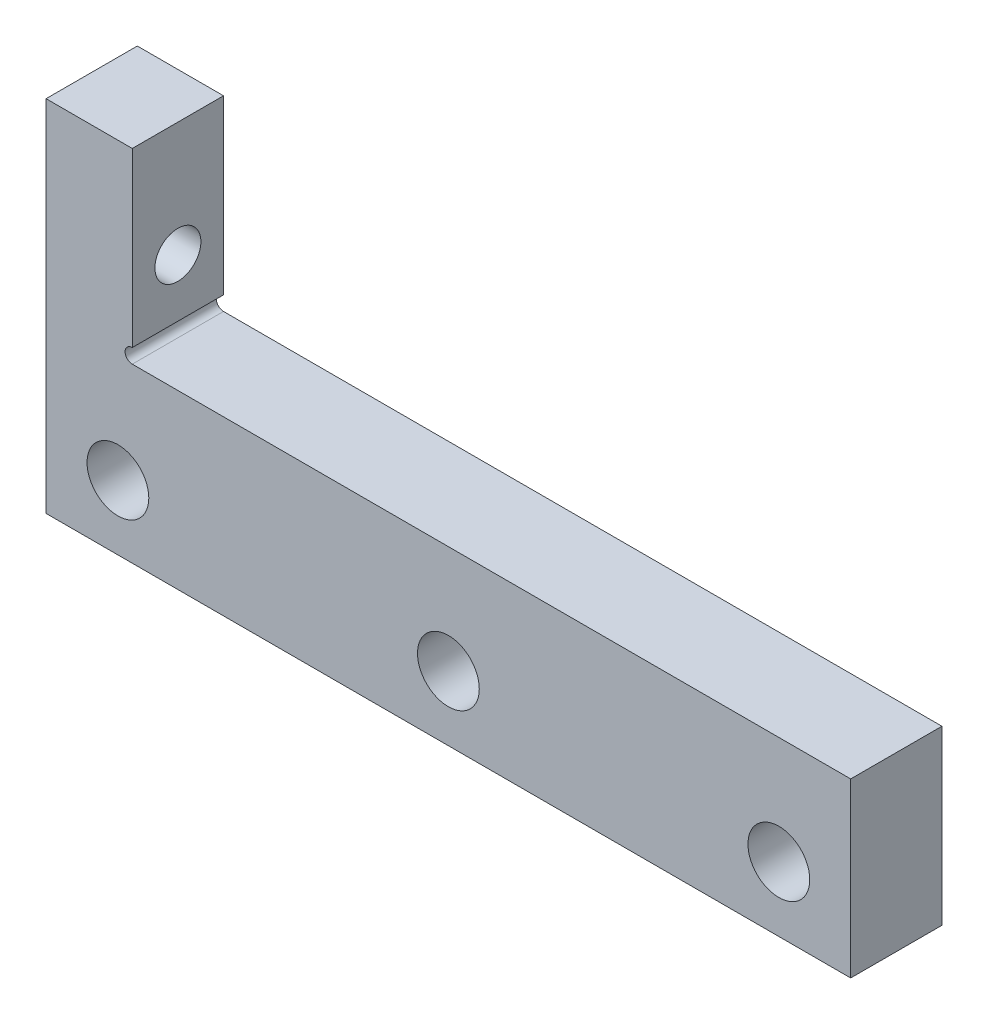
ISO-10303-21;
HEADER;
FILE_DESCRIPTION(('STEP AP214'),'2;1');
FILE_NAME('part.step','',(''),(''),'','','');
FILE_SCHEMA(('AUTOMOTIVE_DESIGN { 1 0 10303 214 1 1 1 1 }'));
ENDSEC;
DATA;
#1=APPLICATION_CONTEXT('core data for automotive mechanical design processes');
#2=APPLICATION_PROTOCOL_DEFINITION('international standard','automotive_design',2000,#1);
#3=PRODUCT_CONTEXT('',#1,'mechanical');
#4=PRODUCT('Part','Part','',(#3));
#5=PRODUCT_RELATED_PRODUCT_CATEGORY('part','',(#4));
#6=PRODUCT_DEFINITION_FORMATION('','',#4);
#7=PRODUCT_DEFINITION_CONTEXT('part definition',#1,'design');
#8=PRODUCT_DEFINITION('design','',#6,#7);
#9=PRODUCT_DEFINITION_SHAPE('','',#8);
#10=(LENGTH_UNIT() NAMED_UNIT(*) SI_UNIT(.MILLI.,.METRE.));
#11=(NAMED_UNIT(*) PLANE_ANGLE_UNIT() SI_UNIT($,.RADIAN.));
#12=(NAMED_UNIT(*) SI_UNIT($,.STERADIAN.) SOLID_ANGLE_UNIT());
#13=UNCERTAINTY_MEASURE_WITH_UNIT(LENGTH_MEASURE(1.E-05),#10,'distance_accuracy_value','');
#14=(GEOMETRIC_REPRESENTATION_CONTEXT(3) GLOBAL_UNCERTAINTY_ASSIGNED_CONTEXT((#13)) GLOBAL_UNIT_ASSIGNED_CONTEXT((#10,
#11,#12)) REPRESENTATION_CONTEXT('',''));
#15=CARTESIAN_POINT('',(0.,0.,0.));
#16=DIRECTION('',(0.,0.,1.));
#17=DIRECTION('',(1.,0.,0.));
#18=AXIS2_PLACEMENT_3D('',#15,#16,#17);
#19=CARTESIAN_POINT('',(-14.499,169.786291501016,0.));
#20=DIRECTION('',(-1.,0.,0.));
#21=DIRECTION('',(0.,-1.,0.));
#22=AXIS2_PLACEMENT_3D('',#19,#20,#21);
#23=CYLINDRICAL_SURFACE('',#22,1.6);
#24=CARTESIAN_POINT('',(-64.5,169.786291501016,0.));
#25=DIRECTION('',(-1.,0.,0.));
#26=DIRECTION('',(0.,0.,1.));
#27=AXIS2_PLACEMENT_3D('',#24,#25,#26);
#28=CIRCLE('',#27,1.6);
#29=CARTESIAN_POINT('',(-64.5,169.786291501016,1.6));
#30=VERTEX_POINT('',#29);
#31=EDGE_CURVE('E111',#30,#30,#28,.F.);
#32=ORIENTED_EDGE('',*,*,#31,.T.);
#33=EDGE_LOOP('',(#32));
#34=FACE_BOUND('',#33,.T.);
#35=CARTESIAN_POINT('',(-68.,169.786291501016,0.));
#36=DIRECTION('',(-1.,0.,0.));
#37=DIRECTION('',(0.,-1.,0.));
#38=AXIS2_PLACEMENT_3D('',#35,#36,#37);
#39=CIRCLE('',#38,1.6);
#40=CARTESIAN_POINT('',(-68.,168.186291501016,0.));
#41=VERTEX_POINT('',#40);
#42=EDGE_CURVE('E35',#41,#41,#39,.F.);
#43=ORIENTED_EDGE('',*,*,#42,.F.);
#44=EDGE_LOOP('',(#43));
#45=FACE_BOUND('',#44,.T.);
#46=ADVANCED_FACE('F31',(#34,#45),#23,.F.);
#47=CARTESIAN_POINT('',(-65.5,157.286291501019,64.5019924258466));
#48=DIRECTION('',(0.,0.,-1.));
#49=DIRECTION('',(-1.,0.,0.));
#50=AXIS2_PLACEMENT_3D('',#47,#48,#49);
#51=CYLINDRICAL_SURFACE('',#50,2.15);
#52=CARTESIAN_POINT('',(-65.5,157.286291501019,3.175));
#53=DIRECTION('',(0.,0.,1.));
#54=DIRECTION('',(1.,0.,0.));
#55=AXIS2_PLACEMENT_3D('',#52,#53,#54);
#56=CIRCLE('',#55,2.15);
#57=CARTESIAN_POINT('',(-63.35,157.286291501019,3.175));
#58=VERTEX_POINT('',#57);
#59=EDGE_CURVE('E138',#58,#58,#56,.T.);
#60=ORIENTED_EDGE('',*,*,#59,.T.);
#61=EDGE_LOOP('',(#60));
#62=FACE_BOUND('',#61,.T.);
#63=CARTESIAN_POINT('',(-65.5,157.286291501019,-3.175));
#64=DIRECTION('',(0.,0.,1.));
#65=DIRECTION('',(1.,0.,0.));
#66=AXIS2_PLACEMENT_3D('',#63,#64,#65);
#67=CIRCLE('',#66,2.15);
#68=CARTESIAN_POINT('',(-63.35,157.286291501019,-3.175));
#69=VERTEX_POINT('',#68);
#70=EDGE_CURVE('E123',#69,#69,#67,.F.);
#71=ORIENTED_EDGE('',*,*,#70,.T.);
#72=EDGE_LOOP('',(#71));
#73=FACE_BOUND('',#72,.T.);
#74=ADVANCED_FACE('F172',(#62,#73),#51,.F.);
#75=CARTESIAN_POINT('',(-70.5,177.786291501017,64.5019924258466));
#76=DIRECTION('',(0.,-1.,0.));
#77=DIRECTION('',(0.,0.,-1.));
#78=AXIS2_PLACEMENT_3D('',#75,#76,#77);
#79=PLANE('',#78);
#80=DIRECTION('',(-1.,0.,0.));
#81=VECTOR('',#80,1.);
#82=CARTESIAN_POINT('',(-70.5,177.786291501017,3.175));
#83=LINE('',#82,#81);
#84=CARTESIAN_POINT('',(-64.5,177.786291501017,3.175));
#85=VERTEX_POINT('',#84);
#86=CARTESIAN_POINT('',(-70.5,177.786291501017,3.175));
#87=VERTEX_POINT('',#86);
#88=EDGE_CURVE('E142',#85,#87,#83,.T.);
#89=ORIENTED_EDGE('',*,*,#88,.F.);
#90=DIRECTION('',(0.,0.,-1.));
#91=VECTOR('',#90,1.);
#92=CARTESIAN_POINT('',(-64.5,177.786291501017,64.5019924258466));
#93=LINE('',#92,#91);
#94=CARTESIAN_POINT('',(-64.5,177.786291501017,-3.175));
#95=VERTEX_POINT('',#94);
#96=EDGE_CURVE('E48',#85,#95,#93,.T.);
#97=ORIENTED_EDGE('',*,*,#96,.T.);
#98=DIRECTION('',(1.,0.,0.));
#99=VECTOR('',#98,1.);
#100=CARTESIAN_POINT('',(-70.5,177.786291501017,-3.175));
#101=LINE('',#100,#99);
#102=CARTESIAN_POINT('',(-70.5,177.786291501017,-3.175));
#103=VERTEX_POINT('',#102);
#104=EDGE_CURVE('E120',#103,#95,#101,.T.);
#105=ORIENTED_EDGE('',*,*,#104,.F.);
#106=DIRECTION('',(0.,0.,-1.));
#107=VECTOR('',#106,1.);
#108=CARTESIAN_POINT('',(-70.5,177.786291501017,64.5019924258466));
#109=LINE('',#108,#107);
#110=EDGE_CURVE('E159',#87,#103,#109,.T.);
#111=ORIENTED_EDGE('',*,*,#110,.F.);
#112=EDGE_LOOP('',(#89,#97,#105,#111));
#113=FACE_BOUND('',#112,.T.);
#114=ADVANCED_FACE('F194',(#113),#79,.F.);
#115=CARTESIAN_POINT('',(-64.5,177.786291501017,64.5019924258466));
#116=DIRECTION('',(-1.,0.,0.));
#117=DIRECTION('',(0.,0.,1.));
#118=AXIS2_PLACEMENT_3D('',#115,#116,#117);
#119=PLANE('',#118);
#120=ORIENTED_EDGE('',*,*,#31,.F.);
#121=EDGE_LOOP('',(#120));
#122=FACE_BOUND('',#121,.T.);
#123=DIRECTION('',(0.,1.,0.));
#124=VECTOR('',#123,1.);
#125=CARTESIAN_POINT('',(-64.5,177.786291501017,3.175));
#126=LINE('',#125,#124);
#127=CARTESIAN_POINT('',(-64.5,165.78629150102,3.175));
#128=VERTEX_POINT('',#127);
#129=EDGE_CURVE('E145',#128,#85,#126,.T.);
#130=ORIENTED_EDGE('',*,*,#129,.F.);
#131=DIRECTION('',(0.,0.,-1.));
#132=VECTOR('',#131,1.);
#133=CARTESIAN_POINT('',(-64.5,165.78629150102,64.5019924258466));
#134=LINE('',#133,#132);
#135=CARTESIAN_POINT('',(-64.5,165.78629150102,-3.175));
#136=VERTEX_POINT('',#135);
#137=EDGE_CURVE('E162',#128,#136,#134,.T.);
#138=ORIENTED_EDGE('',*,*,#137,.T.);
#139=DIRECTION('',(0.,-1.,0.));
#140=VECTOR('',#139,1.);
#141=CARTESIAN_POINT('',(-64.5,177.786291501017,-3.175));
#142=LINE('',#141,#140);
#143=EDGE_CURVE('E128',#95,#136,#142,.T.);
#144=ORIENTED_EDGE('',*,*,#143,.F.);
#145=ORIENTED_EDGE('',*,*,#96,.F.);
#146=EDGE_LOOP('',(#130,#138,#144,#145));
#147=FACE_BOUND('',#146,.T.);
#148=ADVANCED_FACE('F245',(#122,#147),#119,.F.);
#149=CARTESIAN_POINT('',(-64.5000000000001,165.28629150102,64.5019924258466));
#150=DIRECTION('',(0.,0.,-1.));
#151=DIRECTION('',(-1.,0.,0.));
#152=AXIS2_PLACEMENT_3D('',#149,#150,#151);
#153=CYLINDRICAL_SURFACE('',#152,0.499999999999973);
#154=CARTESIAN_POINT('',(-64.5000000000001,165.28629150102,3.175));
#155=DIRECTION('',(0.,0.,1.));
#156=DIRECTION('',(1.,0.,0.));
#157=AXIS2_PLACEMENT_3D('',#154,#155,#156);
#158=CIRCLE('',#157,0.499999999999973);
#159=CARTESIAN_POINT('',(-64.5000000000001,164.78629150102,3.175));
#160=VERTEX_POINT('',#159);
#161=EDGE_CURVE('E148',#160,#128,#158,.F.);
#162=ORIENTED_EDGE('',*,*,#161,.F.);
#163=DIRECTION('',(0.,0.,-1.));
#164=VECTOR('',#163,1.);
#165=CARTESIAN_POINT('',(-64.5000000000001,164.78629150102,64.5019924258466));
#166=LINE('',#165,#164);
#167=CARTESIAN_POINT('',(-64.5000000000001,164.78629150102,-3.175));
#168=VERTEX_POINT('',#167);
#169=EDGE_CURVE('E164',#160,#168,#166,.T.);
#170=ORIENTED_EDGE('',*,*,#169,.T.);
#171=CARTESIAN_POINT('',(-64.5000000000001,165.28629150102,-3.175));
#172=DIRECTION('',(0.,0.,1.));
#173=DIRECTION('',(1.,0.,0.));
#174=AXIS2_PLACEMENT_3D('',#171,#172,#173);
#175=CIRCLE('',#174,0.499999999999973);
#176=EDGE_CURVE('E126',#136,#168,#175,.T.);
#177=ORIENTED_EDGE('',*,*,#176,.F.);
#178=ORIENTED_EDGE('',*,*,#137,.F.);
#179=EDGE_LOOP('',(#162,#170,#177,#178));
#180=FACE_BOUND('',#179,.T.);
#181=ADVANCED_FACE('F247',(#180),#153,.F.);
#182=CARTESIAN_POINT('',(-59.5,164.786291501016,64.5019924258466));
#183=DIRECTION('',(-7.16093850883224E-13,-1.,0.));
#184=DIRECTION('',(1.,-7.16093850883224E-13,0.));
#185=AXIS2_PLACEMENT_3D('',#182,#183,#184);
#186=PLANE('',#185);
#187=DIRECTION('',(-1.,7.16093850883224E-13,0.));
#188=VECTOR('',#187,1.);
#189=CARTESIAN_POINT('',(-59.5,164.786291501016,3.175));
#190=LINE('',#189,#188);
#191=CARTESIAN_POINT('',(-14.5,164.78629150102,3.175));
#192=VERTEX_POINT('',#191);
#193=EDGE_CURVE('E151',#192,#160,#190,.T.);
#194=ORIENTED_EDGE('',*,*,#193,.F.);
#195=DIRECTION('',(0.,0.,-1.));
#196=VECTOR('',#195,1.);
#197=CARTESIAN_POINT('',(-14.5,164.78629150102,64.5019924258466));
#198=LINE('',#197,#196);
#199=CARTESIAN_POINT('',(-14.5,164.78629150102,-3.175));
#200=VERTEX_POINT('',#199);
#201=EDGE_CURVE('E98',#192,#200,#198,.T.);
#202=ORIENTED_EDGE('',*,*,#201,.T.);
#203=DIRECTION('',(1.,-7.16093850883224E-13,0.));
#204=VECTOR('',#203,1.);
#205=CARTESIAN_POINT('',(-59.5,164.786291501016,-3.175));
#206=LINE('',#205,#204);
#207=EDGE_CURVE('E110',#168,#200,#206,.T.);
#208=ORIENTED_EDGE('',*,*,#207,.F.);
#209=ORIENTED_EDGE('',*,*,#169,.F.);
#210=EDGE_LOOP('',(#194,#202,#208,#209));
#211=FACE_BOUND('',#210,.T.);
#212=ADVANCED_FACE('F255',(#211),#186,.F.);
#213=CARTESIAN_POINT('',(-14.5,164.78629150102,64.5019924258466));
#214=DIRECTION('',(-1.,0.,0.));
#215=DIRECTION('',(0.,-1.,0.));
#216=AXIS2_PLACEMENT_3D('',#213,#214,#215);
#217=PLANE('',#216);
#218=DIRECTION('',(0.,1.,0.));
#219=VECTOR('',#218,1.);
#220=CARTESIAN_POINT('',(-14.5,164.78629150102,3.175));
#221=LINE('',#220,#219);
#222=CARTESIAN_POINT('',(-14.5,152.78629150102,3.175));
#223=VERTEX_POINT('',#222);
#224=EDGE_CURVE('E96',#223,#192,#221,.T.);
#225=ORIENTED_EDGE('',*,*,#224,.F.);
#226=DIRECTION('',(0.,0.,-1.));
#227=VECTOR('',#226,1.);
#228=CARTESIAN_POINT('',(-14.5,152.78629150102,64.5019924258466));
#229=LINE('',#228,#227);
#230=CARTESIAN_POINT('',(-14.5,152.78629150102,-3.175));
#231=VERTEX_POINT('',#230);
#232=EDGE_CURVE('E40',#223,#231,#229,.T.);
#233=ORIENTED_EDGE('',*,*,#232,.T.);
#234=DIRECTION('',(0.,-1.,0.));
#235=VECTOR('',#234,1.);
#236=CARTESIAN_POINT('',(-14.5,164.78629150102,-3.175));
#237=LINE('',#236,#235);
#238=EDGE_CURVE('E94',#200,#231,#237,.T.);
#239=ORIENTED_EDGE('',*,*,#238,.F.);
#240=ORIENTED_EDGE('',*,*,#201,.F.);
#241=EDGE_LOOP('',(#225,#233,#239,#240));
#242=FACE_BOUND('',#241,.T.);
#243=ADVANCED_FACE('F92',(#242),#217,.F.);
#244=CARTESIAN_POINT('',(-14.5,152.78629150102,64.5019924258466));
#245=DIRECTION('',(0.,1.,0.));
#246=DIRECTION('',(0.,0.,1.));
#247=AXIS2_PLACEMENT_3D('',#244,#245,#246);
#248=PLANE('',#247);
#249=DIRECTION('',(1.,0.,0.));
#250=VECTOR('',#249,1.);
#251=CARTESIAN_POINT('',(-14.5,152.78629150102,3.175));
#252=LINE('',#251,#250);
#253=CARTESIAN_POINT('',(-70.5000000000001,152.78629150102,3.175));
#254=VERTEX_POINT('',#253);
#255=EDGE_CURVE('E55',#254,#223,#252,.T.);
#256=ORIENTED_EDGE('',*,*,#255,.F.);
#257=DIRECTION('',(0.,0.,-1.));
#258=VECTOR('',#257,1.);
#259=CARTESIAN_POINT('',(-70.5000000000001,152.78629150102,64.5019924258466));
#260=LINE('',#259,#258);
#261=CARTESIAN_POINT('',(-70.5000000000001,152.78629150102,-3.175));
#262=VERTEX_POINT('',#261);
#263=EDGE_CURVE('E11',#254,#262,#260,.T.);
#264=ORIENTED_EDGE('',*,*,#263,.T.);
#265=DIRECTION('',(-1.,0.,0.));
#266=VECTOR('',#265,1.);
#267=CARTESIAN_POINT('',(-14.5,152.78629150102,-3.175));
#268=LINE('',#267,#266);
#269=EDGE_CURVE('E106',#231,#262,#268,.T.);
#270=ORIENTED_EDGE('',*,*,#269,.F.);
#271=ORIENTED_EDGE('',*,*,#232,.F.);
#272=EDGE_LOOP('',(#256,#264,#270,#271));
#273=FACE_BOUND('',#272,.T.);
#274=ADVANCED_FACE('F113',(#273),#248,.F.);
#275=CARTESIAN_POINT('',(-70.5000000000001,152.78629150102,64.5019924258466));
#276=DIRECTION('',(1.,0.,0.));
#277=DIRECTION('',(0.,1.,0.));
#278=AXIS2_PLACEMENT_3D('',#275,#276,#277);
#279=PLANE('',#278);
#280=CARTESIAN_POINT('',(-70.5000000000001,164.286291501016,0.));
#281=DIRECTION('',(-1.,0.,0.));
#282=DIRECTION('',(0.,-1.,0.));
#283=AXIS2_PLACEMENT_3D('',#280,#281,#282);
#284=CIRCLE('',#283,1.34999999999999);
#285=CARTESIAN_POINT('',(-70.5000000000001,162.936291501016,0.));
#286=VERTEX_POINT('',#285);
#287=EDGE_CURVE('E224',#286,#286,#284,.T.);
#288=ORIENTED_EDGE('',*,*,#287,.F.);
#289=EDGE_LOOP('',(#288));
#290=FACE_BOUND('',#289,.T.);
#291=CARTESIAN_POINT('',(-70.5,175.286291501016,0.));
#292=DIRECTION('',(-1.,0.,0.));
#293=DIRECTION('',(0.,-1.,0.));
#294=AXIS2_PLACEMENT_3D('',#291,#292,#293);
#295=CIRCLE('',#294,1.34999999999999);
#296=CARTESIAN_POINT('',(-70.5,173.936291501016,0.));
#297=VERTEX_POINT('',#296);
#298=EDGE_CURVE('E223',#297,#297,#295,.T.);
#299=ORIENTED_EDGE('',*,*,#298,.F.);
#300=EDGE_LOOP('',(#299));
#301=FACE_BOUND('',#300,.T.);
#302=CARTESIAN_POINT('',(-70.5,169.786291501016,0.));
#303=DIRECTION('',(-1.,0.,0.));
#304=DIRECTION('',(0.,-1.,0.));
#305=AXIS2_PLACEMENT_3D('',#302,#303,#304);
#306=CIRCLE('',#305,3.);
#307=CARTESIAN_POINT('',(-70.5,166.786291501016,0.));
#308=VERTEX_POINT('',#307);
#309=EDGE_CURVE('E233',#308,#308,#306,.T.);
#310=ORIENTED_EDGE('',*,*,#309,.F.);
#311=EDGE_LOOP('',(#310));
#312=FACE_BOUND('',#311,.T.);
#313=DIRECTION('',(0.,-1.,0.));
#314=VECTOR('',#313,1.);
#315=CARTESIAN_POINT('',(-70.5000000000001,152.78629150102,3.175));
#316=LINE('',#315,#314);
#317=EDGE_CURVE('E156',#87,#254,#316,.T.);
#318=ORIENTED_EDGE('',*,*,#317,.F.);
#319=ORIENTED_EDGE('',*,*,#110,.T.);
#320=DIRECTION('',(0.,1.,0.));
#321=VECTOR('',#320,1.);
#322=CARTESIAN_POINT('',(-70.5000000000001,152.78629150102,-3.175));
#323=LINE('',#322,#321);
#324=EDGE_CURVE('E115',#262,#103,#323,.T.);
#325=ORIENTED_EDGE('',*,*,#324,.F.);
#326=ORIENTED_EDGE('',*,*,#263,.F.);
#327=EDGE_LOOP('',(#318,#319,#325,#326));
#328=FACE_BOUND('',#327,.T.);
#329=ADVANCED_FACE('F33',(#290,#301,#312,#328),#279,.F.);
#330=CARTESIAN_POINT('',(-42.5,157.286291501019,64.5019924258466));
#331=DIRECTION('',(0.,0.,-1.));
#332=DIRECTION('',(-1.,0.,0.));
#333=AXIS2_PLACEMENT_3D('',#330,#331,#332);
#334=CYLINDRICAL_SURFACE('',#333,2.15000000000002);
#335=CARTESIAN_POINT('',(-42.5,157.286291501019,3.175));
#336=DIRECTION('',(0.,0.,1.));
#337=DIRECTION('',(1.,0.,0.));
#338=AXIS2_PLACEMENT_3D('',#335,#336,#337);
#339=CIRCLE('',#338,2.15000000000002);
#340=CARTESIAN_POINT('',(-40.35,157.286291501019,3.175));
#341=VERTEX_POINT('',#340);
#342=EDGE_CURVE('E135',#341,#341,#339,.T.);
#343=ORIENTED_EDGE('',*,*,#342,.T.);
#344=EDGE_LOOP('',(#343));
#345=FACE_BOUND('',#344,.T.);
#346=CARTESIAN_POINT('',(-42.5,157.286291501019,-3.175));
#347=DIRECTION('',(0.,0.,1.));
#348=DIRECTION('',(1.,0.,0.));
#349=AXIS2_PLACEMENT_3D('',#346,#347,#348);
#350=CIRCLE('',#349,2.15000000000002);
#351=CARTESIAN_POINT('',(-40.35,157.286291501019,-3.175));
#352=VERTEX_POINT('',#351);
#353=EDGE_CURVE('E114',#352,#352,#350,.F.);
#354=ORIENTED_EDGE('',*,*,#353,.T.);
#355=EDGE_LOOP('',(#354));
#356=FACE_BOUND('',#355,.T.);
#357=ADVANCED_FACE('F261',(#345,#356),#334,.F.);
#358=CARTESIAN_POINT('',(-19.5,157.286291501019,64.5019924258466));
#359=DIRECTION('',(0.,0.,-1.));
#360=DIRECTION('',(-1.,0.,0.));
#361=AXIS2_PLACEMENT_3D('',#358,#359,#360);
#362=CYLINDRICAL_SURFACE('',#361,2.15000000000002);
#363=CARTESIAN_POINT('',(-19.5,157.286291501019,3.175));
#364=DIRECTION('',(0.,0.,1.));
#365=DIRECTION('',(1.,0.,0.));
#366=AXIS2_PLACEMENT_3D('',#363,#364,#365);
#367=CIRCLE('',#366,2.15000000000002);
#368=CARTESIAN_POINT('',(-17.35,157.286291501019,3.175));
#369=VERTEX_POINT('',#368);
#370=EDGE_CURVE('E139',#369,#369,#367,.T.);
#371=ORIENTED_EDGE('',*,*,#370,.T.);
#372=EDGE_LOOP('',(#371));
#373=FACE_BOUND('',#372,.T.);
#374=CARTESIAN_POINT('',(-19.5,157.286291501019,-3.175));
#375=DIRECTION('',(0.,0.,1.));
#376=DIRECTION('',(1.,0.,0.));
#377=AXIS2_PLACEMENT_3D('',#374,#375,#376);
#378=CIRCLE('',#377,2.15000000000002);
#379=CARTESIAN_POINT('',(-17.35,157.286291501019,-3.175));
#380=VERTEX_POINT('',#379);
#381=EDGE_CURVE('E118',#380,#380,#378,.F.);
#382=ORIENTED_EDGE('',*,*,#381,.T.);
#383=EDGE_LOOP('',(#382));
#384=FACE_BOUND('',#383,.T.);
#385=ADVANCED_FACE('F185',(#373,#384),#362,.F.);
#386=CARTESIAN_POINT('',(-17.6999999999969,174.786291501019,3.175));
#387=DIRECTION('',(0.,0.,1.));
#388=DIRECTION('',(1.,0.,0.));
#389=AXIS2_PLACEMENT_3D('',#386,#387,#388);
#390=PLANE('',#389);
#391=ORIENTED_EDGE('',*,*,#370,.F.);
#392=EDGE_LOOP('',(#391));
#393=FACE_BOUND('',#392,.T.);
#394=ORIENTED_EDGE('',*,*,#342,.F.);
#395=EDGE_LOOP('',(#394));
#396=FACE_BOUND('',#395,.T.);
#397=ORIENTED_EDGE('',*,*,#59,.F.);
#398=EDGE_LOOP('',(#397));
#399=FACE_BOUND('',#398,.T.);
#400=ORIENTED_EDGE('',*,*,#88,.T.);
#401=ORIENTED_EDGE('',*,*,#317,.T.);
#402=ORIENTED_EDGE('',*,*,#255,.T.);
#403=ORIENTED_EDGE('',*,*,#224,.T.);
#404=ORIENTED_EDGE('',*,*,#193,.T.);
#405=ORIENTED_EDGE('',*,*,#161,.T.);
#406=ORIENTED_EDGE('',*,*,#129,.T.);
#407=EDGE_LOOP('',(#400,#401,#402,#403,#404,#405,#406));
#408=FACE_BOUND('',#407,.T.);
#409=ADVANCED_FACE('F176',(#393,#396,#399,#408),#390,.T.);
#410=CARTESIAN_POINT('',(-17.6999999999969,174.786291501019,-3.175));
#411=DIRECTION('',(0.,0.,1.));
#412=DIRECTION('',(1.,0.,0.));
#413=AXIS2_PLACEMENT_3D('',#410,#411,#412);
#414=PLANE('',#413);
#415=ORIENTED_EDGE('',*,*,#324,.T.);
#416=ORIENTED_EDGE('',*,*,#104,.T.);
#417=ORIENTED_EDGE('',*,*,#143,.T.);
#418=ORIENTED_EDGE('',*,*,#176,.T.);
#419=ORIENTED_EDGE('',*,*,#207,.T.);
#420=ORIENTED_EDGE('',*,*,#238,.T.);
#421=ORIENTED_EDGE('',*,*,#269,.T.);
#422=EDGE_LOOP('',(#415,#416,#417,#418,#419,#420,#421));
#423=FACE_BOUND('',#422,.T.);
#424=ORIENTED_EDGE('',*,*,#353,.F.);
#425=EDGE_LOOP('',(#424));
#426=FACE_BOUND('',#425,.T.);
#427=ORIENTED_EDGE('',*,*,#381,.F.);
#428=EDGE_LOOP('',(#427));
#429=FACE_BOUND('',#428,.T.);
#430=ORIENTED_EDGE('',*,*,#70,.F.);
#431=EDGE_LOOP('',(#430));
#432=FACE_BOUND('',#431,.T.);
#433=ADVANCED_FACE('F104',(#423,#426,#429,#432),#414,.F.);
#434=CARTESIAN_POINT('',(-68.,169.786291501016,0.));
#435=DIRECTION('',(-1.,0.,0.));
#436=DIRECTION('',(0.,-1.,0.));
#437=AXIS2_PLACEMENT_3D('',#434,#435,#436);
#438=PLANE('',#437);
#439=CARTESIAN_POINT('',(-68.,169.786291501016,0.));
#440=DIRECTION('',(-1.,0.,0.));
#441=DIRECTION('',(0.,-1.,0.));
#442=AXIS2_PLACEMENT_3D('',#439,#440,#441);
#443=CIRCLE('',#442,3.);
#444=CARTESIAN_POINT('',(-68.,166.786291501016,0.));
#445=VERTEX_POINT('',#444);
#446=EDGE_CURVE('E235',#445,#445,#443,.T.);
#447=ORIENTED_EDGE('',*,*,#446,.T.);
#448=EDGE_LOOP('',(#447));
#449=FACE_BOUND('',#448,.T.);
#450=ORIENTED_EDGE('',*,*,#42,.T.);
#451=EDGE_LOOP('',(#450));
#452=FACE_BOUND('',#451,.T.);
#453=ADVANCED_FACE('F175',(#449,#452),#438,.T.);
#454=CARTESIAN_POINT('',(-68.,169.786291501016,0.));
#455=DIRECTION('',(-1.,0.,0.));
#456=DIRECTION('',(0.,-1.,0.));
#457=AXIS2_PLACEMENT_3D('',#454,#455,#456);
#458=CYLINDRICAL_SURFACE('',#457,3.);
#459=ORIENTED_EDGE('',*,*,#446,.F.);
#460=EDGE_LOOP('',(#459));
#461=FACE_BOUND('',#460,.T.);
#462=ORIENTED_EDGE('',*,*,#309,.T.);
#463=EDGE_LOOP('',(#462));
#464=FACE_BOUND('',#463,.T.);
#465=ADVANCED_FACE('F182',(#461,#464),#458,.F.);
#466=CARTESIAN_POINT('',(-65.5,175.286291501016,0.));
#467=DIRECTION('',(-1.,0.,0.));
#468=DIRECTION('',(0.,-1.,0.));
#469=AXIS2_PLACEMENT_3D('',#466,#467,#468);
#470=CYLINDRICAL_SURFACE('',#469,1.34999999999999);
#471=CARTESIAN_POINT('',(-65.5,175.286291501016,0.));
#472=DIRECTION('',(-1.,0.,0.));
#473=DIRECTION('',(0.,-1.,0.));
#474=AXIS2_PLACEMENT_3D('',#471,#472,#473);
#475=CIRCLE('',#474,1.34999999999999);
#476=CARTESIAN_POINT('',(-65.5,173.936291501016,0.));
#477=VERTEX_POINT('',#476);
#478=EDGE_CURVE('E227',#477,#477,#475,.T.);
#479=ORIENTED_EDGE('',*,*,#478,.F.);
#480=EDGE_LOOP('',(#479));
#481=FACE_BOUND('',#480,.T.);
#482=ORIENTED_EDGE('',*,*,#298,.T.);
#483=EDGE_LOOP('',(#482));
#484=FACE_BOUND('',#483,.T.);
#485=ADVANCED_FACE('F201',(#481,#484),#470,.F.);
#486=CARTESIAN_POINT('',(-65.5,175.286291501016,0.));
#487=DIRECTION('',(-1.,0.,0.));
#488=DIRECTION('',(0.,-1.,0.));
#489=AXIS2_PLACEMENT_3D('',#486,#487,#488);
#490=PLANE('',#489);
#491=ORIENTED_EDGE('',*,*,#478,.T.);
#492=EDGE_LOOP('',(#491));
#493=FACE_BOUND('',#492,.T.);
#494=ADVANCED_FACE('F206',(#493),#490,.T.);
#495=CARTESIAN_POINT('',(-65.5000000000001,164.286291501016,0.));
#496=DIRECTION('',(-1.,0.,0.));
#497=DIRECTION('',(0.,-1.,0.));
#498=AXIS2_PLACEMENT_3D('',#495,#496,#497);
#499=CYLINDRICAL_SURFACE('',#498,1.34999999999999);
#500=CARTESIAN_POINT('',(-65.5000000000001,164.286291501016,0.));
#501=DIRECTION('',(-1.,0.,0.));
#502=DIRECTION('',(0.,-1.,0.));
#503=AXIS2_PLACEMENT_3D('',#500,#501,#502);
#504=CIRCLE('',#503,1.34999999999999);
#505=CARTESIAN_POINT('',(-65.5000000000001,162.936291501016,0.));
#506=VERTEX_POINT('',#505);
#507=EDGE_CURVE('E222',#506,#506,#504,.T.);
#508=ORIENTED_EDGE('',*,*,#507,.F.);
#509=EDGE_LOOP('',(#508));
#510=FACE_BOUND('',#509,.T.);
#511=ORIENTED_EDGE('',*,*,#287,.T.);
#512=EDGE_LOOP('',(#511));
#513=FACE_BOUND('',#512,.T.);
#514=ADVANCED_FACE('F210',(#510,#513),#499,.F.);
#515=CARTESIAN_POINT('',(-65.5000000000001,164.286291501016,0.));
#516=DIRECTION('',(-1.,0.,0.));
#517=DIRECTION('',(0.,-1.,0.));
#518=AXIS2_PLACEMENT_3D('',#515,#516,#517);
#519=PLANE('',#518);
#520=ORIENTED_EDGE('',*,*,#507,.T.);
#521=EDGE_LOOP('',(#520));
#522=FACE_BOUND('',#521,.T.);
#523=ADVANCED_FACE('F214',(#522),#519,.T.);
#524=CLOSED_SHELL('',(#46,#74,#114,#148,#181,#212,#243,#274,#329,#357,#385,#409,#433,#453,#465,
#485,#494,#514,#523));
#525=MANIFOLD_SOLID_BREP('B2',#524);
#526=ADVANCED_BREP_SHAPE_REPRESENTATION('',(#18,#525),#14);
#527=SHAPE_DEFINITION_REPRESENTATION(#9,#526);
ENDSEC;
END-ISO-10303-21;
